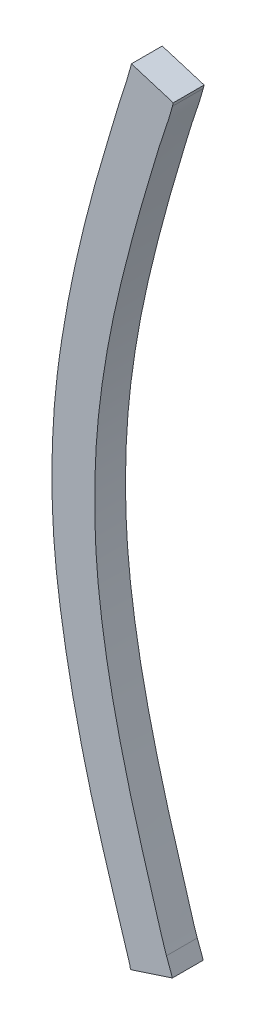
ISO-10303-21;
HEADER;
FILE_DESCRIPTION(('STEP AP214'),'2;1');
FILE_NAME('part.step','',(''),(''),'','','');
FILE_SCHEMA(('AUTOMOTIVE_DESIGN { 1 0 10303 214 1 1 1 1 }'));
ENDSEC;
DATA;
#1=APPLICATION_CONTEXT('core data for automotive mechanical design processes');
#2=APPLICATION_PROTOCOL_DEFINITION('international standard','automotive_design',2000,#1);
#3=PRODUCT_CONTEXT('',#1,'mechanical');
#4=PRODUCT('Part','Part','',(#3));
#5=PRODUCT_RELATED_PRODUCT_CATEGORY('part','',(#4));
#6=PRODUCT_DEFINITION_FORMATION('','',#4);
#7=PRODUCT_DEFINITION_CONTEXT('part definition',#1,'design');
#8=PRODUCT_DEFINITION('design','',#6,#7);
#9=PRODUCT_DEFINITION_SHAPE('','',#8);
#10=(LENGTH_UNIT() NAMED_UNIT(*) SI_UNIT(.MILLI.,.METRE.));
#11=(NAMED_UNIT(*) PLANE_ANGLE_UNIT() SI_UNIT($,.RADIAN.));
#12=(NAMED_UNIT(*) SI_UNIT($,.STERADIAN.) SOLID_ANGLE_UNIT());
#13=UNCERTAINTY_MEASURE_WITH_UNIT(LENGTH_MEASURE(1.E-05),#10,'distance_accuracy_value','');
#14=(GEOMETRIC_REPRESENTATION_CONTEXT(3) GLOBAL_UNCERTAINTY_ASSIGNED_CONTEXT((#13)) GLOBAL_UNIT_ASSIGNED_CONTEXT((#10,
#11,#12)) REPRESENTATION_CONTEXT('',''));
#15=CARTESIAN_POINT('',(0.,0.,0.));
#16=DIRECTION('',(0.,0.,1.));
#17=DIRECTION('',(1.,0.,0.));
#18=AXIS2_PLACEMENT_3D('',#15,#16,#17);
#19=CARTESIAN_POINT('',(60.7958701691964,66.6710436811986,-39.1));
#20=DIRECTION('',(0.,0.,1.));
#21=DIRECTION('',(1.,0.,0.));
#22=AXIS2_PLACEMENT_3D('',#19,#20,#21);
#23=PLANE('',#22);
#24=CARTESIAN_POINT('',(60.9093242956903,65.3880537824811,-39.1));
#25=CARTESIAN_POINT('',(60.9043145744516,65.4039224211055,-39.1));
#26=CARTESIAN_POINT('',(60.8993313666407,65.4197993983538,-39.1));
#27=CARTESIAN_POINT('',(60.8894090701893,65.4515664146494,-39.1));
#28=CARTESIAN_POINT('',(60.8844699797269,65.4674564531274,-39.1));
#29=CARTESIAN_POINT('',(60.8746108316944,65.4992982074446,-39.1));
#30=CARTESIAN_POINT('',(60.8696908857604,65.515249957815,-39.1));
#31=CARTESIAN_POINT('',(60.8598785683024,65.5471627233694,-39.1));
#32=CARTESIAN_POINT('',(60.8549861980328,65.5631237389391,-39.1));
#33=CARTESIAN_POINT('',(60.8402799251201,65.6111693789549,-39.1));
#34=CARTESIAN_POINT('',(60.8304851193492,65.6432598179885,-39.1));
#35=CARTESIAN_POINT('',(60.8112556226589,65.7075484327984,-39.1));
#36=CARTESIAN_POINT('',(60.8018209103206,65.7397466020424,-39.1));
#37=CARTESIAN_POINT('',(60.7837281454986,65.8043649262814,-39.1));
#38=CARTESIAN_POINT('',(60.7750701597987,65.8367851001071,-39.1));
#39=CARTESIAN_POINT('',(60.7584950586661,65.9018137150433,-39.1));
#40=CARTESIAN_POINT('',(60.7505779500766,65.9344221578898,-39.1));
#41=CARTESIAN_POINT('',(60.7355240864214,65.9996529739616,-39.1));
#42=CARTESIAN_POINT('',(60.728383730476,66.0322745114678,-39.1));
#43=CARTESIAN_POINT('',(60.7149649054837,66.0976974416464,-39.1));
#44=CARTESIAN_POINT('',(60.7086865132394,66.1304988500752,-39.1));
#45=CARTESIAN_POINT('',(60.6968908821274,66.1962383388991,-39.1));
#46=CARTESIAN_POINT('',(60.691373661243,66.2291764225045,-39.1));
#47=CARTESIAN_POINT('',(60.6812517967816,66.2951912621979,-39.1));
#48=CARTESIAN_POINT('',(60.6766470143854,66.3282679964084,-39.1));
#49=CARTESIAN_POINT('',(60.6687722310097,66.3950348297252,-39.1));
#50=CARTESIAN_POINT('',(60.6655209549731,66.4287272064063,-39.1));
#51=CARTESIAN_POINT('',(60.6605832606378,66.4962291333749,-39.1));
#52=CARTESIAN_POINT('',(60.6588970160241,66.5300386962497,-39.1));
#53=CARTESIAN_POINT('',(60.6569415602159,66.5976833497231,-39.1));
#54=CARTESIAN_POINT('',(60.656671777525,66.6315184245167,-39.1));
#55=CARTESIAN_POINT('',(60.6575023836958,66.6991692599932,-39.1));
#56=CARTESIAN_POINT('',(60.6586026885523,66.7329850217332,-39.1));
#57=CARTESIAN_POINT('',(60.6621887501934,66.8007757586242,-39.1));
#58=CARTESIAN_POINT('',(60.6646838928858,66.8347502493339,-39.1));
#59=CARTESIAN_POINT('',(60.6711833493845,66.902554898238,-39.1));
#60=CARTESIAN_POINT('',(60.6751877277553,66.936385050195,-39.1));
#61=CARTESIAN_POINT('',(60.6843690652335,67.0038927091767,-39.1));
#62=CARTESIAN_POINT('',(60.6895464464632,67.0375701567874,-39.1));
#63=CARTESIAN_POINT('',(60.7007260682266,67.1047876243946,-39.1));
#64=CARTESIAN_POINT('',(60.7067283116156,67.138327643915,-39.1));
#65=CARTESIAN_POINT('',(60.7193047950785,67.2032564911107,-39.1));
#66=CARTESIAN_POINT('',(60.725824637445,67.2346558295527,-39.1));
#67=CARTESIAN_POINT('',(60.7395911216698,67.2972926267339,-39.1));
#68=CARTESIAN_POINT('',(60.7468377514517,67.3285300881539,-39.1));
#69=CARTESIAN_POINT('',(60.7619010461954,67.3908634012156,-39.1));
#70=CARTESIAN_POINT('',(60.7697176503886,67.4219592675792,-39.1));
#71=CARTESIAN_POINT('',(60.7859559820666,67.4839926615588,-39.1));
#72=CARTESIAN_POINT('',(60.794377702822,67.5149301909316,-39.1));
#73=CARTESIAN_POINT('',(60.8073869907392,67.5610174047168,-39.1));
#74=CARTESIAN_POINT('',(60.8117566872409,67.5762290269035,-39.1));
#75=CARTESIAN_POINT('',(60.8206125754568,67.60661857774,-39.1));
#76=CARTESIAN_POINT('',(60.8250987694561,67.6217965057224,-39.1));
#77=CARTESIAN_POINT('',(60.8341258581609,67.6521365070966,-39.1));
#78=CARTESIAN_POINT('',(60.8386667544368,67.6672985800196,-39.1));
#79=CARTESIAN_POINT('',(60.8476912057924,67.6976393691907,-39.1));
#80=CARTESIAN_POINT('',(60.8521747618447,67.7128180851517,-39.1));
#81=CARTESIAN_POINT('',(60.8611317418558,67.7431718761001,-39.1));
#82=CARTESIAN_POINT('',(60.8656051693697,67.7583469498054,-39.1));
#83=CARTESIAN_POINT('',(60.8748229411846,67.7886148801133,-39.1));
#84=CARTESIAN_POINT('',(60.879567289268,67.8037077355647,-39.1));
#85=CARTESIAN_POINT('',(60.8893151427128,67.8338121724158,-39.1));
#86=CARTESIAN_POINT('',(60.8943186557328,67.8488237513991,-39.1));
#87=CARTESIAN_POINT('',(60.9037994217836,67.8790070706326,-39.1));
#88=CARTESIAN_POINT('',(60.9082766795295,67.8941788094464,-39.1));
#89=CARTESIAN_POINT('',(60.9120982207903,67.9095517020411,-39.1));
#90=B_SPLINE_CURVE_WITH_KNOTS('',3,(#24,#25,#26,#27,#28,#29,#30,#31,#32,#33,#34,#35,#36,#37,#38,
#39,#40,#41,#42,#43,#44,#45,#46,#47,#48,#49,#50,#51,#52,#53,#54,#55,#56,#57,#58,#59,#60,#61,#62,
#63,#64,#65,#66,#67,#68,#69,#70,#71,#72,#73,#74,#75,#76,#77,#78,#79,#80,#81,#82,#83,#84,#85,#86,
#87,#88,#89),.UNSPECIFIED.,.F.,.F.,(4,2,2,2,2,2,2,2,2,2,2,2,2,2,2,2,2,2,2,2,2,2,2,2,2,2,2,2,2,2,
2,2,4),(0.,0.0499218624120883,0.0998416537036679,0.149921340589625,0.200003287339097,
0.300659293450722,0.401309303081491,0.501967958441903,0.602627543466672,0.702798586796466,
0.802978549775832,0.90316087918596,1.00332795504435,1.10483809656498,1.20635950219524,
1.30783994408395,1.40931416412882,1.51147957229387,1.61364935155878,1.71585595669374,
1.81806291563396,1.91425915316305,2.01045379253944,2.1066381909322,2.2028215198612,
2.25030146479508,2.29778234175143,2.34526458513203,2.39274602212263,2.44020683593431,
2.48766831252677,2.53513119247088,2.58259364712009),.UNSPECIFIED.);
#91=CARTESIAN_POINT('',(60.9093242956884,65.3880537824808,-39.1));
#92=VERTEX_POINT('',#91);
#93=CARTESIAN_POINT('',(60.9120982207903,67.9095517020411,-39.1));
#94=VERTEX_POINT('',#93);
#95=EDGE_CURVE('E117',#92,#94,#90,.T.);
#96=ORIENTED_EDGE('',*,*,#95,.T.);
#97=DIRECTION('',(0.242535625039973,0.970142500144422,0.));
#98=VECTOR('',#97,1.);
#99=CARTESIAN_POINT('',(60.9148721458951,67.9206474024599,-39.1));
#100=LINE('',#99,#98);
#101=CARTESIAN_POINT('',(60.914872145895,67.9206474024597,-39.1));
#102=VERTEX_POINT('',#101);
#103=EDGE_CURVE('E131',#94,#102,#100,.T.);
#104=ORIENTED_EDGE('',*,*,#103,.T.);
#105=DIRECTION('',(0.95619995550737,-0.292714272094314,0.));
#106=VECTOR('',#105,1.);
#107=CARTESIAN_POINT('',(61.0507944759928,67.8790385258991,-39.1));
#108=LINE('',#107,#106);
#109=CARTESIAN_POINT('',(61.0507944759919,67.8790385258964,-39.1));
#110=VERTEX_POINT('',#109);
#111=EDGE_CURVE('E137',#102,#110,#108,.T.);
#112=ORIENTED_EDGE('',*,*,#111,.T.);
#113=DIRECTION('',(-0.242535625038331,-0.970142500144832,0.));
#114=VECTOR('',#113,1.);
#115=CARTESIAN_POINT('',(61.0480205508879,67.8679428254817,-39.1));
#116=LINE('',#115,#114);
#117=CARTESIAN_POINT('',(61.0480205508891,67.8679428254814,-39.1));
#118=VERTEX_POINT('',#117);
#119=EDGE_CURVE('E143',#110,#118,#116,.T.);
#120=ORIENTED_EDGE('',*,*,#119,.T.);
#121=CARTESIAN_POINT('',(61.0480205508903,67.8679428254811,-39.1));
#122=CARTESIAN_POINT('',(61.0439915712356,67.8517366635282,-39.1));
#123=CARTESIAN_POINT('',(61.0391223545473,67.835798023788,-39.1));
#124=CARTESIAN_POINT('',(61.0287564063209,67.8041184091699,-39.1));
#125=CARTESIAN_POINT('',(61.0232596743748,67.7883774344206,-39.1));
#126=CARTESIAN_POINT('',(61.0126743235473,67.7567039077578,-39.1));
#127=CARTESIAN_POINT('',(61.0075871030635,67.7407708966897,-39.1));
#128=CARTESIAN_POINT('',(60.9977542725651,67.7088006865625,-39.1));
#129=CARTESIAN_POINT('',(60.993008664572,67.6927634868875,-39.1));
#130=CARTESIAN_POINT('',(60.9834924739786,67.6606574064975,-39.1));
#131=CARTESIAN_POINT('',(60.9787218591218,67.6445885367192,-39.1));
#132=CARTESIAN_POINT('',(60.9691636402412,67.6124558292216,-39.1));
#133=CARTESIAN_POINT('',(60.9643760363428,67.5963919914661,-39.1));
#134=CARTESIAN_POINT('',(60.9501833852663,67.5481510598995,-39.1));
#135=CARTESIAN_POINT('',(60.9409481726815,67.5159234946727,-39.1));
#136=CARTESIAN_POINT('',(60.9230370644909,67.4513060039297,-39.1));
#137=CARTESIAN_POINT('',(60.9143612908222,67.4189160446646,-39.1));
#138=CARTESIAN_POINT('',(60.8974726566221,67.3540143794858,-39.1));
#139=CARTESIAN_POINT('',(60.8892598176141,67.3215026679862,-39.1));
#140=CARTESIAN_POINT('',(60.8735096231019,67.256478106558,-39.1));
#141=CARTESIAN_POINT('',(60.8659692191372,67.2239660087317,-39.1));
#142=CARTESIAN_POINT('',(60.8519135156038,67.1587194441111,-39.1));
#143=CARTESIAN_POINT('',(60.8453981995136,67.1259849809097,-39.1));
#144=CARTESIAN_POINT('',(60.8333856585469,67.0603405600356,-39.1));
#145=CARTESIAN_POINT('',(60.8278881365176,67.0274306564801,-39.1));
#146=CARTESIAN_POINT('',(60.8179832886137,66.9614458833999,-39.1));
#147=CARTESIAN_POINT('',(60.8135759010002,66.9283710233256,-39.1));
#148=CARTESIAN_POINT('',(60.8061408877871,66.8615570812594,-39.1));
#149=CARTESIAN_POINT('',(60.803135132054,66.827815517682,-39.1));
#150=CARTESIAN_POINT('',(60.7986165041744,66.7602304271542,-39.1));
#151=CARTESIAN_POINT('',(60.7971037998209,66.7263868891724,-39.1));
#152=CARTESIAN_POINT('',(60.7954815459725,66.6586678422972,-39.1));
#153=CARTESIAN_POINT('',(60.7953719390386,66.6247923347695,-39.1));
#154=CARTESIAN_POINT('',(60.7966206966505,66.5570720815247,-39.1));
#155=CARTESIAN_POINT('',(60.7979788382,66.5232273319165,-39.1));
#156=CARTESIAN_POINT('',(60.8022722470573,66.455406050314,-39.1));
#157=CARTESIAN_POINT('',(60.8052181452229,66.4214301807032,-39.1));
#158=CARTESIAN_POINT('',(60.8126189385864,66.3536442406892,-39.1));
#159=CARTESIAN_POINT('',(60.8170740626805,66.3198341962254,-39.1));
#160=CARTESIAN_POINT('',(60.8321176014455,66.2186424285987,-39.1));
#161=CARTESIAN_POINT('',(60.8443838638007,66.1515029797264,-39.1));
#162=CARTESIAN_POINT('',(60.8643129964403,66.0587238026394,-39.1));
#163=CARTESIAN_POINT('',(60.870234530564,66.0326938760454,-39.1));
#164=CARTESIAN_POINT('',(60.882525092062,65.98073922907,-39.1));
#165=CARTESIAN_POINT('',(60.8888941278095,65.9548145106667,-39.1));
#166=CARTESIAN_POINT('',(60.9019990952321,65.9030618349992,-39.1));
#167=CARTESIAN_POINT('',(60.9087349734806,65.8772338642272,-39.1));
#168=CARTESIAN_POINT('',(60.9226823308897,65.8257075554701,-39.1));
#169=CARTESIAN_POINT('',(60.9298937968862,65.8000092139179,-39.1));
#170=CARTESIAN_POINT('',(60.9408535292658,65.7616624642494,-39.1));
#171=CARTESIAN_POINT('',(60.944508814253,65.7489869951614,-39.1));
#172=CARTESIAN_POINT('',(60.9518732121326,65.7236519408814,-39.1));
#173=CARTESIAN_POINT('',(60.9555823237847,65.7109923553307,-39.1));
#174=CARTESIAN_POINT('',(60.9630750504445,65.6856946143677,-39.1));
#175=CARTESIAN_POINT('',(60.9668586684625,65.6730564598436,-39.1));
#176=CARTESIAN_POINT('',(60.9745098613374,65.6478056456199,-39.1));
#177=CARTESIAN_POINT('',(60.9783774371653,65.635192986217,-39.1));
#178=CARTESIAN_POINT('',(60.9860987859169,65.6099667512251,-39.1));
#179=CARTESIAN_POINT('',(60.989952562341,65.59735317684,-39.1));
#180=CARTESIAN_POINT('',(60.9974794487539,65.572073249238,-39.1));
#181=CARTESIAN_POINT('',(61.0011525622501,65.5594068970509,-39.1));
#182=CARTESIAN_POINT('',(61.0084833804121,65.5340669954853,-39.1));
#183=CARTESIAN_POINT('',(61.0121410848176,65.5213934459893,-39.1));
#184=CARTESIAN_POINT('',(61.0199124174948,65.4961880735421,-39.1));
#185=CARTESIAN_POINT('',(61.0240261106618,65.4836562710445,-39.1));
#186=CARTESIAN_POINT('',(61.0286030750903,65.4712715356011,-39.1));
#187=B_SPLINE_CURVE_WITH_KNOTS('',3,(#121,#122,#123,#124,#125,#126,#127,#128,#129,#130,#131,
#132,#133,#134,#135,#136,#137,#138,#139,#140,#141,#142,#143,#144,#145,#146,#147,#148,#149,#150,
#151,#152,#153,#154,#155,#156,#157,#158,#159,#160,#161,#162,#163,#164,#165,#166,#167,#168,#169,
#170,#171,#172,#173,#174,#175,#176,#177,#178,#179,#180,#181,#182,#183,#184,#185,#186),
.UNSPECIFIED.,.F.,.F.,(4,2,2,2,2,2,2,2,2,2,2,2,2,2,2,2,2,2,2,2,2,2,2,2,2,2,2,2,2,2,2,2,4),(0.,
0.0500080145666276,0.100016061646279,0.150188208383201,0.200360651978025,0.250647248356933,
0.300933474457003,0.401502619593345,0.502093611529947,0.602689276425291,0.702802863768886,
0.80291483739868,0.902997536313469,1.0030745658297,1.10466477805423,1.2062664059448,
1.3078638745311,1.40944590950309,1.51171669521768,1.61400299873923,1.818587346217,
1.89866936470076,1.97875288198646,2.05882476701014,2.13889443659769,2.17847046458432,
2.21804558217623,2.25762230199392,2.29719947975455,2.33676578330499,2.37633131839219,
2.41589751922909,2.45546935827181),.UNSPECIFIED.);
#188=CARTESIAN_POINT('',(61.0286030750903,65.4712715356011,-39.1));
#189=VERTEX_POINT('',#188);
#190=EDGE_CURVE('E24',#118,#189,#187,.T.);
#191=ORIENTED_EDGE('',*,*,#190,.T.);
#192=DIRECTION('',(0.345705358827352,-0.938343116817112,0.));
#193=VECTOR('',#192,1.);
#194=CARTESIAN_POINT('',(61.048020550825,65.4185669586071,-39.1));
#195=LINE('',#194,#193);
#196=CARTESIAN_POINT('',(61.0480205508241,65.4185669586095,-39.1));
#197=VERTEX_POINT('',#196);
#198=EDGE_CURVE('E83',#189,#197,#195,.T.);
#199=ORIENTED_EDGE('',*,*,#198,.T.);
#200=DIRECTION('',(-0.950605456490995,-0.310401781711295,0.));
#201=VECTOR('',#200,1.);
#202=CARTESIAN_POINT('',(60.9120982207889,65.3741841569654,-39.1));
#203=LINE('',#202,#201);
#204=CARTESIAN_POINT('',(60.9120982207894,65.374184156964,-39.1));
#205=VERTEX_POINT('',#204);
#206=EDGE_CURVE('E90',#197,#205,#203,.T.);
#207=ORIENTED_EDGE('',*,*,#206,.T.);
#208=DIRECTION('',(-0.196116135136651,0.980580675691227,0.));
#209=VECTOR('',#208,1.);
#210=CARTESIAN_POINT('',(60.9093242956865,65.3880537824804,-39.1));
#211=LINE('',#210,#209);
#212=EDGE_CURVE('E125',#205,#92,#211,.T.);
#213=ORIENTED_EDGE('',*,*,#212,.T.);
#214=EDGE_LOOP('',(#96,#104,#112,#120,#191,#199,#207,#213));
#215=FACE_BOUND('',#214,.T.);
#216=ADVANCED_FACE('F17',(#215),#23,.F.);
#217=CARTESIAN_POINT('',(60.9093242956865,65.3880537824804,-39.));
#218=DIRECTION('',(0.980580675691227,0.196116135136651,0.));
#219=DIRECTION('',(-0.196116135136651,0.980580675691227,0.));
#220=AXIS2_PLACEMENT_3D('',#217,#218,#219);
#221=PLANE('',#220);
#222=DIRECTION('',(0.,0.,1.));
#223=VECTOR('',#222,1.);
#224=CARTESIAN_POINT('',(60.9120982207889,65.3741841569654,-39.));
#225=LINE('',#224,#223);
#226=CARTESIAN_POINT('',(60.9120982207898,65.3741841569625,-39.));
#227=VERTEX_POINT('',#226);
#228=EDGE_CURVE('E95',#205,#227,#225,.T.);
#229=ORIENTED_EDGE('',*,*,#228,.T.);
#230=DIRECTION('',(0.196116135134316,-0.980580675691694,0.));
#231=VECTOR('',#230,1.);
#232=CARTESIAN_POINT('',(60.9093242956865,65.3880537824804,-39.));
#233=LINE('',#232,#231);
#234=CARTESIAN_POINT('',(60.9093242956884,65.3880537824808,-39.));
#235=VERTEX_POINT('',#234);
#236=EDGE_CURVE('E115',#235,#227,#233,.T.);
#237=ORIENTED_EDGE('',*,*,#236,.F.);
#238=DIRECTION('',(0.,0.,-1.));
#239=VECTOR('',#238,1.);
#240=CARTESIAN_POINT('',(60.9093242956903,65.3880537824811,-39.05));
#241=LINE('',#240,#239);
#242=EDGE_CURVE('E197',#235,#92,#241,.T.);
#243=ORIENTED_EDGE('',*,*,#242,.T.);
#244=ORIENTED_EDGE('',*,*,#212,.F.);
#245=EDGE_LOOP('',(#229,#237,#243,#244));
#246=FACE_BOUND('',#245,.T.);
#247=ADVANCED_FACE('F183',(#246),#221,.F.);
#248=CARTESIAN_POINT('',(60.9120982207889,65.3741841569654,-39.));
#249=DIRECTION('',(-0.310401781711295,0.950605456490995,0.));
#250=DIRECTION('',(-0.950605456490995,-0.310401781711295,0.));
#251=AXIS2_PLACEMENT_3D('',#248,#249,#250);
#252=PLANE('',#251);
#253=DIRECTION('',(0.,0.,1.));
#254=VECTOR('',#253,1.);
#255=CARTESIAN_POINT('',(61.0480205508241,65.4185669586095,-39.));
#256=LINE('',#255,#254);
#257=CARTESIAN_POINT('',(61.0480205508242,65.4185669586095,-39.));
#258=VERTEX_POINT('',#257);
#259=EDGE_CURVE('E97',#197,#258,#256,.T.);
#260=ORIENTED_EDGE('',*,*,#259,.T.);
#261=DIRECTION('',(0.950605456481307,0.310401781740966,0.));
#262=VECTOR('',#261,1.);
#263=CARTESIAN_POINT('',(60.9120982207903,65.3741841569611,-39.));
#264=LINE('',#263,#262);
#265=EDGE_CURVE('E101',#227,#258,#264,.T.);
#266=ORIENTED_EDGE('',*,*,#265,.F.);
#267=ORIENTED_EDGE('',*,*,#228,.F.);
#268=ORIENTED_EDGE('',*,*,#206,.F.);
#269=EDGE_LOOP('',(#260,#266,#267,#268));
#270=FACE_BOUND('',#269,.T.);
#271=ADVANCED_FACE('F99',(#270),#252,.F.);
#272=CARTESIAN_POINT('',(61.048020550825,65.4185669586071,-39.));
#273=DIRECTION('',(-0.938343116817112,-0.345705358827352,0.));
#274=DIRECTION('',(0.345705358827352,-0.938343116817112,0.));
#275=AXIS2_PLACEMENT_3D('',#272,#273,#274);
#276=PLANE('',#275);
#277=DIRECTION('',(0.,0.,1.));
#278=VECTOR('',#277,1.);
#279=CARTESIAN_POINT('',(61.0286030750903,65.4712715356011,-39.05));
#280=LINE('',#279,#278);
#281=CARTESIAN_POINT('',(61.0286030750903,65.4712715356011,-39.));
#282=VERTEX_POINT('',#281);
#283=EDGE_CURVE('E107',#189,#282,#280,.T.);
#284=ORIENTED_EDGE('',*,*,#283,.T.);
#285=DIRECTION('',(-0.345705358829933,0.938343116816161,0.));
#286=VECTOR('',#285,1.);
#287=CARTESIAN_POINT('',(61.0480205508242,65.4185669586095,-39.));
#288=LINE('',#287,#286);
#289=EDGE_CURVE('E105',#258,#282,#288,.T.);
#290=ORIENTED_EDGE('',*,*,#289,.F.);
#291=ORIENTED_EDGE('',*,*,#259,.F.);
#292=ORIENTED_EDGE('',*,*,#198,.F.);
#293=EDGE_LOOP('',(#284,#290,#291,#292));
#294=FACE_BOUND('',#293,.T.);
#295=ADVANCED_FACE('F106',(#294),#276,.F.);
#296=CARTESIAN_POINT('',(61.0286030750903,65.4712715356011,-39.));
#297=CARTESIAN_POINT('',(61.0286030750903,65.4712715356011,-39.1));
#298=CARTESIAN_POINT('',(61.0172061777903,65.5022059711811,-39.));
#299=CARTESIAN_POINT('',(61.0172061777903,65.5022059711811,-39.1));
#300=CARTESIAN_POINT('',(60.9999058412903,65.5659821748511,-39.));
#301=CARTESIAN_POINT('',(60.9999058412903,65.5659821748511,-39.1));
#302=CARTESIAN_POINT('',(60.9703752940903,65.6604634257111,-39.));
#303=CARTESIAN_POINT('',(60.9703752940903,65.6604634257111,-39.1));
#304=CARTESIAN_POINT('',(60.9424446410903,65.7555881904911,-39.));
#305=CARTESIAN_POINT('',(60.9424446410903,65.7555881904911,-39.1));
#306=CARTESIAN_POINT('',(60.9154263320903,65.8510828608411,-39.));
#307=CARTESIAN_POINT('',(60.9154263320903,65.8510828608411,-39.1));
#308=CARTESIAN_POINT('',(60.8905399314903,65.9472874887411,-39.));
#309=CARTESIAN_POINT('',(60.8905399314903,65.9472874887411,-39.1));
#310=CARTESIAN_POINT('',(60.8673151642903,66.0439631431511,-39.));
#311=CARTESIAN_POINT('',(60.8673151642903,66.0439631431511,-39.1));
#312=CARTESIAN_POINT('',(60.8465477349903,66.1411280540311,-39.));
#313=CARTESIAN_POINT('',(60.8465477349903,66.1411280540311,-39.1));
#314=CARTESIAN_POINT('',(60.8290331732903,66.2387361052611,-39.));
#315=CARTESIAN_POINT('',(60.8290331732903,66.2387361052611,-39.1));
#316=CARTESIAN_POINT('',(60.8143925046903,66.3366485426511,-39.));
#317=CARTESIAN_POINT('',(60.8143925046903,66.3366485426511,-39.1));
#318=CARTESIAN_POINT('',(60.8034669421903,66.4350688603111,-39.));
#319=CARTESIAN_POINT('',(60.8034669421903,66.4350688603111,-39.1));
#320=CARTESIAN_POINT('',(60.7970224355903,66.5341052922411,-39.));
#321=CARTESIAN_POINT('',(60.7970224355903,66.5341052922411,-39.1));
#322=CARTESIAN_POINT('',(60.7948508530903,66.6358584039211,-39.));
#323=CARTESIAN_POINT('',(60.7948508530903,66.6358584039211,-39.1));
#324=CARTESIAN_POINT('',(60.7971208353903,66.7396214222211,-39.));
#325=CARTESIAN_POINT('',(60.7971208353903,66.7396214222211,-39.1));
#326=CARTESIAN_POINT('',(60.8039856532903,66.8446802711711,-39.));
#327=CARTESIAN_POINT('',(60.8039856532903,66.8446802711711,-39.1));
#328=CARTESIAN_POINT('',(60.8156980950903,66.9483503945711,-39.));
#329=CARTESIAN_POINT('',(60.8156980950903,66.9483503945711,-39.1));
#330=CARTESIAN_POINT('',(60.8314586174903,67.0510408543211,-39.));
#331=CARTESIAN_POINT('',(60.8314586174903,67.0510408543211,-39.1));
#332=CARTESIAN_POINT('',(60.8503467341903,67.1532827809011,-39.));
#333=CARTESIAN_POINT('',(60.8503467341903,67.1532827809011,-39.1));
#334=CARTESIAN_POINT('',(60.8728805500903,67.2551487434211,-39.));
#335=CARTESIAN_POINT('',(60.8728805500903,67.2551487434211,-39.1));
#336=CARTESIAN_POINT('',(60.8980094303903,67.3568289901211,-39.));
#337=CARTESIAN_POINT('',(60.8980094303903,67.3568289901211,-39.1));
#338=CARTESIAN_POINT('',(60.9247931968903,67.4585626101411,-39.));
#339=CARTESIAN_POINT('',(60.9247931968903,67.4585626101411,-39.1));
#340=CARTESIAN_POINT('',(60.9534796822903,67.5603545641311,-39.));
#341=CARTESIAN_POINT('',(60.9534796822903,67.5603545641311,-39.1));
#342=CARTESIAN_POINT('',(60.9841376843903,67.6623217389711,-39.));
#343=CARTESIAN_POINT('',(60.9841376843903,67.6623217389711,-39.1));
#344=CARTESIAN_POINT('',(61.0142277012903,67.7653465070011,-39.));
#345=CARTESIAN_POINT('',(61.0142277012903,67.7653465070011,-39.1));
#346=CARTESIAN_POINT('',(61.0392652433903,67.8329215956811,-39.));
#347=CARTESIAN_POINT('',(61.0392652433903,67.8329215956811,-39.1));
#348=CARTESIAN_POINT('',(61.0480205508903,67.8679428254811,-39.));
#349=CARTESIAN_POINT('',(61.0480205508903,67.8679428254811,-39.1));
#350=B_SPLINE_SURFACE_WITH_KNOTS('',3,1,((#296,#297),(#298,#299),(#300,#301),(#302,#303),(#304,
#305),(#306,#307),(#308,#309),(#310,#311),(#312,#313),(#314,#315),(#316,#317),(#318,#319),(#320,
#321),(#322,#323),(#324,#325),(#326,#327),(#328,#329),(#330,#331),(#332,#333),(#334,#335),(#336,
#337),(#338,#339),(#340,#341),(#342,#343),(#344,#345),(#346,#347),(#348,#349)),.UNSPECIFIED.,
.F.,.F.,.F.,(4,1,1,1,1,1,1,1,1,1,1,1,1,1,1,1,1,1,1,1,1,1,1,1,4),(2,2),(0.,0.040278248287,
0.0806030195706,0.120976211563,0.1613914804331,0.2018527253488,0.2423754497267,0.282860879271,
0.3232278266937,0.3635154620948,0.4037973774836,0.444176179008,0.4847294139046,0.5281075982527,
0.5709411647974,0.613316156209,0.655530962379,0.6978516332957,0.7403231878101,0.7829751165553,
0.8258128210892,0.8688486812,0.91217934840788,0.95589519433079,1.),(1.,1.1),.UNSPECIFIED.);
#351=DIRECTION('',(0.,0.,1.));
#352=VECTOR('',#351,1.);
#353=CARTESIAN_POINT('',(61.0480205508879,67.8679428254817,-39.));
#354=LINE('',#353,#352);
#355=CARTESIAN_POINT('',(61.0480205508891,67.8679428254814,-39.));
#356=VERTEX_POINT('',#355);
#357=EDGE_CURVE('E145',#118,#356,#354,.T.);
#358=CARTESIAN_POINT('',(61.0286030750903,65.4712715356011,-39.));
#359=CARTESIAN_POINT('',(61.022837311903,65.4869369549547,-39.));
#360=CARTESIAN_POINT('',(61.0177756750015,65.5028191289054,-39.));
#361=CARTESIAN_POINT('',(61.0081989014491,65.5347524081146,-39.));
#362=CARTESIAN_POINT('',(61.0036837539255,65.5508035100051,-39.));
#363=CARTESIAN_POINT('',(60.9943253410185,65.5828542235398,-39.));
#364=CARTESIAN_POINT('',(60.9894812168997,65.5988535765336,-39.));
#365=CARTESIAN_POINT('',(60.9797226630709,65.6308313231936,-39.));
#366=CARTESIAN_POINT('',(60.9748082317353,65.6468097163659,-39.));
#367=CARTESIAN_POINT('',(60.9602389221578,65.6949295976216,-39.));
#368=CARTESIAN_POINT('',(60.9507968135109,65.727135362519,-39.));
#369=CARTESIAN_POINT('',(60.9322421808691,65.7916435482185,-39.));
#370=CARTESIAN_POINT('',(60.9231296672372,65.8239459720252,-39.));
#371=CARTESIAN_POINT('',(60.9056500952782,65.8887612724291,-39.));
#372=CARTESIAN_POINT('',(60.8972832202083,65.9212741986674,-39.));
#373=CARTESIAN_POINT('',(60.881120710744,65.9864397861142,-39.));
#374=CARTESIAN_POINT('',(60.8733250515373,66.0190924411878,-39.));
#375=CARTESIAN_POINT('',(60.8586224937319,66.0845028378707,-39.));
#376=CARTESIAN_POINT('',(60.8517131185314,66.1172600123611,-39.));
#377=CARTESIAN_POINT('',(60.8389873412138,66.1829887345277,-39.));
#378=CARTESIAN_POINT('',(60.8331710364634,66.2159603010307,-39.));
#379=CARTESIAN_POINT('',(60.8225255365093,66.2820409265251,-39.));
#380=CARTESIAN_POINT('',(60.8176956951035,66.3151498809182,-39.));
#381=CARTESIAN_POINT('',(60.8093568230015,66.3815329834266,-39.));
#382=CARTESIAN_POINT('',(60.8058475663003,66.4148071022871,-39.));
#383=CARTESIAN_POINT('',(60.8003707925801,66.4815286113504,-39.));
#384=CARTESIAN_POINT('',(60.7984054040972,66.5149761769982,-39.));
#385=CARTESIAN_POINT('',(60.7959379761014,66.5819271155906,-39.));
#386=CARTESIAN_POINT('',(60.7954360868806,66.6154304939135,-39.));
#387=CARTESIAN_POINT('',(60.795835661054,66.6824331378755,-39.));
#388=CARTESIAN_POINT('',(60.796737343056,66.7159324020612,-39.));
#389=CARTESIAN_POINT('',(60.799927742547,66.7828653226747,-39.));
#390=CARTESIAN_POINT('',(60.8022163912261,66.8162989822746,-39.));
#391=CARTESIAN_POINT('',(60.8072335729571,66.8712502282108,-39.));
#392=CARTESIAN_POINT('',(60.8095217684912,66.8928087805907,-39.));
#393=CARTESIAN_POINT('',(60.8146655927532,66.9358575753048,-39.));
#394=CARTESIAN_POINT('',(60.8175212188083,66.9573478179601,-39.));
#395=CARTESIAN_POINT('',(60.8237339237035,67.0002581062123,-39.));
#396=CARTESIAN_POINT('',(60.8270910747143,67.021678141252,-39.));
#397=CARTESIAN_POINT('',(60.8342144259563,67.064449683911,-39.));
#398=CARTESIAN_POINT('',(60.8379806227012,67.0858011921127,-39.));
#399=CARTESIAN_POINT('',(60.8459634162671,67.1284616003824,-39.));
#400=CARTESIAN_POINT('',(60.8501808428611,67.149770345914,-39.));
#401=CARTESIAN_POINT('',(60.8590683291676,67.1922926030725,-39.));
#402=CARTESIAN_POINT('',(60.8637383840801,67.2135061157069,-39.));
#403=CARTESIAN_POINT('',(60.8782679736599,67.2770238166438,-39.));
#404=CARTESIAN_POINT('',(60.8886474875586,67.3192080178706,-39.));
#405=CARTESIAN_POINT('',(60.9103675229196,67.4040319137986,-39.));
#406=CARTESIAN_POINT('',(60.921720577391,67.4466683567853,-39.));
#407=CARTESIAN_POINT('',(60.9394448373713,67.5104307556445,-39.));
#408=CARTESIAN_POINT('',(60.945468737861,67.5316529574555,-39.));
#409=CARTESIAN_POINT('',(60.9577634229044,67.5740262294222,-39.));
#410=CARTESIAN_POINT('',(60.9640342168976,67.5951772968245,-39.));
#411=CARTESIAN_POINT('',(60.976559601987,67.6373662046561,-39.));
#412=CARTESIAN_POINT('',(60.9828141117821,67.6584040706146,-39.));
#413=CARTESIAN_POINT('',(60.9921831473805,67.6899651372415,-39.));
#414=CARTESIAN_POINT('',(60.9953040905556,67.7004863825467,-39.));
#415=CARTESIAN_POINT('',(61.0016416435036,67.7214990170634,-39.));
#416=CARTESIAN_POINT('',(61.0048582421564,67.7319904095913,-39.));
#417=CARTESIAN_POINT('',(61.0114788784438,67.7529139463301,-39.));
#418=CARTESIAN_POINT('',(61.0148829085977,67.7633460928874,-39.));
#419=CARTESIAN_POINT('',(61.0218632851719,67.7841519918079,-39.));
#420=CARTESIAN_POINT('',(61.0254396413692,67.7945257408204,-39.));
#421=CARTESIAN_POINT('',(61.0324507302227,67.815323855568,-39.));
#422=CARTESIAN_POINT('',(61.0358854617558,67.8257482217037,-39.));
#423=CARTESIAN_POINT('',(61.0423368104836,67.8467286802744,-39.));
#424=CARTESIAN_POINT('',(61.0453532387462,67.8572848299001,-39.));
#425=CARTESIAN_POINT('',(61.0480205508903,67.8679428254811,-39.));
#426=B_SPLINE_CURVE_WITH_KNOTS('',3,(#358,#359,#360,#361,#362,#363,#364,#365,#366,#367,#368,
#369,#370,#371,#372,#373,#374,#375,#376,#377,#378,#379,#380,#381,#382,#383,#384,#385,#386,#387,
#388,#389,#390,#391,#392,#393,#394,#395,#396,#397,#398,#399,#400,#401,#402,#403,#404,#405,#406,
#407,#408,#409,#410,#411,#412,#413,#414,#415,#416,#417,#418,#419,#420,#421,#422,#423,#424,#425),
.UNSPECIFIED.,.F.,.F.,(4,2,2,2,2,2,2,2,2,2,2,2,2,2,2,2,2,2,2,2,2,2,2,2,2,2,2,2,2,2,2,2,2,4),(0.,
0.0500147149609063,0.100028434683383,0.150178135641947,0.200328998025781,0.301010211702053,
0.401694588225843,0.502403642329667,0.603108319253298,0.703525158329773,0.803950937928785,
0.904310719160453,1.00465331699752,1.10513401586621,1.20562503310728,1.30613170350079,
1.40663338798294,1.47166423077536,1.53669476726521,1.60173467084715,1.66677402015115,
1.73193509662391,1.79709548214279,1.92740754856905,2.05976626068277,2.12594632551909,
2.19212892309246,2.25797283842828,2.29089591289582,2.32381517481961,2.35673312380189,
2.38965294259852,2.42257302242067,2.45550792294245),.UNSPECIFIED.);
#427=EDGE_CURVE('E111',#282,#356,#426,.T.);
#428=ORIENTED_EDGE('',*,*,#357,.T.);
#429=ORIENTED_EDGE('',*,*,#427,.F.);
#430=ORIENTED_EDGE('',*,*,#283,.F.);
#431=ORIENTED_EDGE('',*,*,#190,.F.);
#432=EDGE_LOOP('',(#428,#429,#430,#431));
#433=FACE_BOUND('',#432,.T.);
#434=ADVANCED_FACE('F177',(#433),#350,.F.);
#435=CARTESIAN_POINT('',(61.0480205508879,67.8679428254817,-39.));
#436=DIRECTION('',(-0.970142500144832,0.242535625038331,0.));
#437=DIRECTION('',(-0.242535625038331,-0.970142500144832,0.));
#438=AXIS2_PLACEMENT_3D('',#435,#436,#437);
#439=PLANE('',#438);
#440=DIRECTION('',(0.,0.,1.));
#441=VECTOR('',#440,1.);
#442=CARTESIAN_POINT('',(61.0507944759928,67.8790385258991,-39.));
#443=LINE('',#442,#441);
#444=CARTESIAN_POINT('',(61.0507944759911,67.8790385258938,-39.));
#445=VERTEX_POINT('',#444);
#446=EDGE_CURVE('E140',#110,#445,#443,.T.);
#447=ORIENTED_EDGE('',*,*,#446,.T.);
#448=DIRECTION('',(0.242535624830485,0.970142500196794,0.));
#449=VECTOR('',#448,1.);
#450=CARTESIAN_POINT('',(61.0480205508903,67.8679428254811,-39.));
#451=LINE('',#450,#449);
#452=EDGE_CURVE('E211',#356,#445,#451,.T.);
#453=ORIENTED_EDGE('',*,*,#452,.F.);
#454=ORIENTED_EDGE('',*,*,#357,.F.);
#455=ORIENTED_EDGE('',*,*,#119,.F.);
#456=EDGE_LOOP('',(#447,#453,#454,#455));
#457=FACE_BOUND('',#456,.T.);
#458=ADVANCED_FACE('F173',(#457),#439,.F.);
#459=CARTESIAN_POINT('',(61.0507944759928,67.8790385258991,-39.));
#460=DIRECTION('',(-0.292714272094314,-0.95619995550737,0.));
#461=DIRECTION('',(0.95619995550737,-0.292714272094314,0.));
#462=AXIS2_PLACEMENT_3D('',#459,#460,#461);
#463=PLANE('',#462);
#464=DIRECTION('',(0.,0.,1.));
#465=VECTOR('',#464,1.);
#466=CARTESIAN_POINT('',(60.914872145895,67.9206474024597,-39.));
#467=LINE('',#466,#465);
#468=CARTESIAN_POINT('',(60.914872145895,67.9206474024597,-39.));
#469=VERTEX_POINT('',#468);
#470=EDGE_CURVE('E134',#102,#469,#467,.T.);
#471=ORIENTED_EDGE('',*,*,#470,.T.);
#472=DIRECTION('',(-0.956199955490116,0.292714272150675,0.));
#473=VECTOR('',#472,1.);
#474=CARTESIAN_POINT('',(61.0507944759903,67.8790385258911,-39.));
#475=LINE('',#474,#473);
#476=EDGE_CURVE('E208',#445,#469,#475,.T.);
#477=ORIENTED_EDGE('',*,*,#476,.F.);
#478=ORIENTED_EDGE('',*,*,#446,.F.);
#479=ORIENTED_EDGE('',*,*,#111,.F.);
#480=EDGE_LOOP('',(#471,#477,#478,#479));
#481=FACE_BOUND('',#480,.T.);
#482=ADVANCED_FACE('F170',(#481),#463,.F.);
#483=CARTESIAN_POINT('',(60.9148721458951,67.9206474024599,-39.));
#484=DIRECTION('',(0.970142500144422,-0.242535625039973,0.));
#485=DIRECTION('',(0.242535625039973,0.970142500144422,0.));
#486=AXIS2_PLACEMENT_3D('',#483,#484,#485);
#487=PLANE('',#486);
#488=DIRECTION('',(0.,0.,1.));
#489=VECTOR('',#488,1.);
#490=CARTESIAN_POINT('',(60.9120982207903,67.9095517020411,-39.05));
#491=LINE('',#490,#489);
#492=CARTESIAN_POINT('',(60.9120982207903,67.9095517020411,-39.));
#493=VERTEX_POINT('',#492);
#494=EDGE_CURVE('E44',#94,#493,#491,.T.);
#495=ORIENTED_EDGE('',*,*,#494,.T.);
#496=DIRECTION('',(-0.242535625040616,-0.970142500144261,0.));
#497=VECTOR('',#496,1.);
#498=CARTESIAN_POINT('',(60.914872145895,67.9206474024597,-39.));
#499=LINE('',#498,#497);
#500=EDGE_CURVE('E35',#469,#493,#499,.T.);
#501=ORIENTED_EDGE('',*,*,#500,.F.);
#502=ORIENTED_EDGE('',*,*,#470,.F.);
#503=ORIENTED_EDGE('',*,*,#103,.F.);
#504=EDGE_LOOP('',(#495,#501,#502,#503));
#505=FACE_BOUND('',#504,.T.);
#506=ADVANCED_FACE('F166',(#505),#487,.F.);
#507=CARTESIAN_POINT('',(60.9120982207903,67.9095517020411,-39.));
#508=CARTESIAN_POINT('',(60.9120982207903,67.9095517020411,-39.1));
#509=CARTESIAN_POINT('',(60.9034714246903,67.8750445178511,-39.));
#510=CARTESIAN_POINT('',(60.9034714246903,67.8750445178511,-39.1));
#511=CARTESIAN_POINT('',(60.8798039832903,67.8076442358911,-39.));
#512=CARTESIAN_POINT('',(60.8798039832903,67.8076442358911,-39.1));
#513=CARTESIAN_POINT('',(60.8499912076903,67.7046821442411,-39.));
#514=CARTESIAN_POINT('',(60.8499912076903,67.7046821442411,-39.1));
#515=CARTESIAN_POINT('',(60.8188483337903,67.6016031320011,-39.));
#516=CARTESIAN_POINT('',(60.8188483337903,67.6016031320011,-39.1));
#517=CARTESIAN_POINT('',(60.7893072446903,67.4976279515811,-39.));
#518=CARTESIAN_POINT('',(60.7893072446903,67.4976279515811,-39.1));
#519=CARTESIAN_POINT('',(60.7620785894903,67.3926422512311,-39.));
#520=CARTESIAN_POINT('',(60.7620785894903,67.3926422512311,-39.1));
#521=CARTESIAN_POINT('',(60.7368871273903,67.2868477946411,-39.));
#522=CARTESIAN_POINT('',(60.7368871273903,67.2868477946411,-39.1));
#523=CARTESIAN_POINT('',(60.7142968776903,67.1802658615211,-39.));
#524=CARTESIAN_POINT('',(60.7142968776903,67.1802658615211,-39.1));
#525=CARTESIAN_POINT('',(60.6949493742903,67.0729497432511,-39.));
#526=CARTESIAN_POINT('',(60.6949493742903,67.0729497432511,-39.1));
#527=CARTESIAN_POINT('',(60.6783810173903,66.9649456532711,-39.));
#528=CARTESIAN_POINT('',(60.6783810173903,66.9649456532711,-39.1));
#529=CARTESIAN_POINT('',(60.6658420294903,66.8557941923511,-39.));
#530=CARTESIAN_POINT('',(60.6658420294903,66.8557941923511,-39.1));
#531=CARTESIAN_POINT('',(60.6585309833903,66.7451769925511,-39.));
#532=CARTESIAN_POINT('',(60.6585309833903,66.7451769925511,-39.1));
#533=CARTESIAN_POINT('',(60.6560771001903,66.6347274988212,-39.));
#534=CARTESIAN_POINT('',(60.6560771001903,66.6347274988212,-39.1));
#535=CARTESIAN_POINT('',(60.6585240842903,66.5253539658611,-39.));
#536=CARTESIAN_POINT('',(60.6585240842903,66.5253539658611,-39.1));
#537=CARTESIAN_POINT('',(60.6658531821903,66.4179697436011,-39.));
#538=CARTESIAN_POINT('',(60.6658531821903,66.4179697436011,-39.1));
#539=CARTESIAN_POINT('',(60.6784167928903,66.3118095911711,-39.));
#540=CARTESIAN_POINT('',(60.6784167928903,66.3118095911711,-39.1));
#541=CARTESIAN_POINT('',(60.6948455977903,66.2066484773211,-39.));
#542=CARTESIAN_POINT('',(60.6948455977903,66.2066484773211,-39.1));
#543=CARTESIAN_POINT('',(60.7137364321903,66.1021154829911,-39.));
#544=CARTESIAN_POINT('',(60.7137364321903,66.1021154829911,-39.1));
#545=CARTESIAN_POINT('',(60.7355141657903,65.9982296608211,-39.));
#546=CARTESIAN_POINT('',(60.7355141657903,65.9982296608211,-39.1));
#547=CARTESIAN_POINT('',(60.7599088236903,65.8949694947611,-39.));
#548=CARTESIAN_POINT('',(60.7599088236903,65.8949694947611,-39.1));
#549=CARTESIAN_POINT('',(60.7866680766903,65.7922865190211,-39.));
#550=CARTESIAN_POINT('',(60.7866680766903,65.7922865190211,-39.1));
#551=CARTESIAN_POINT('',(60.8161404543903,65.6904029871811,-39.));
#552=CARTESIAN_POINT('',(60.8161404543903,65.6904029871811,-39.1));
#553=CARTESIAN_POINT('',(60.8469813804903,65.5891578711811,-39.));
#554=CARTESIAN_POINT('',(60.8469813804903,65.5891578711811,-39.1));
#555=CARTESIAN_POINT('',(60.8779155843903,65.4883582177612,-39.));
#556=CARTESIAN_POINT('',(60.8779155843903,65.4883582177612,-39.1));
#557=CARTESIAN_POINT('',(60.8987934945903,65.4214116328112,-39.));
#558=CARTESIAN_POINT('',(60.8987934945903,65.4214116328112,-39.1));
#559=CARTESIAN_POINT('',(60.9093242956903,65.3880537824811,-39.));
#560=CARTESIAN_POINT('',(60.9093242956903,65.3880537824811,-39.1));
#561=B_SPLINE_SURFACE_WITH_KNOTS('',3,1,((#507,#508),(#509,#510),(#511,#512),(#513,#514),(#515,
#516),(#517,#518),(#519,#520),(#521,#522),(#523,#524),(#525,#526),(#527,#528),(#529,#530),(#531,
#532),(#533,#534),(#535,#536),(#537,#538),(#539,#540),(#541,#542),(#543,#544),(#545,#546),(#547,
#548),(#549,#550),(#551,#552),(#553,#554),(#555,#556),(#557,#558),(#559,#560)),.UNSPECIFIED.,
.F.,.F.,.F.,(4,1,1,1,1,1,1,1,1,1,1,1,1,1,1,1,1,1,1,1,1,1,1,1,4),(2,2),(0.,0.0413184722059,
0.0828305644182,0.1245370853061,0.1663972145159,0.2083840662625,0.2505168707437,0.2927190031333,
0.3349258601963,0.3771725185111,0.4196299114956,0.4625105662135,0.5059026791283,0.5479226771341,
0.5895531007979,0.6308841100529,0.6720599694941,0.7131780218303,0.7542676600694,0.7953446009062,
0.8364201547581,0.8775178947493,0.91853849498568,0.95936558638094,1.),(1.,1.1),.UNSPECIFIED.);
#562=CARTESIAN_POINT('',(60.9120982207903,67.9095517020411,-39.));
#563=CARTESIAN_POINT('',(60.9080665186083,67.8933576316954,-39.));
#564=CARTESIAN_POINT('',(60.9033174973871,67.8773846824852,-39.));
#565=CARTESIAN_POINT('',(60.8932787157197,67.8456047553228,-39.));
#566=CARTESIAN_POINT('',(60.8879889772808,67.8297977706446,-39.));
#567=CARTESIAN_POINT('',(60.8777477641815,67.7980274878703,-39.));
#568=CARTESIAN_POINT('',(60.8727972856771,67.7820638746399,-39.));
#569=CARTESIAN_POINT('',(60.8631420388656,67.7500623457538,-39.));
#570=CARTESIAN_POINT('',(60.858437281127,67.7340244269344,-39.));
#571=CARTESIAN_POINT('',(60.8489614144594,67.7019237340227,-39.));
#572=CARTESIAN_POINT('',(60.8441901663757,67.6858610015814,-39.));
#573=CARTESIAN_POINT('',(60.8346158436495,67.6537450015864,-39.));
#574=CARTESIAN_POINT('',(60.8298127688947,67.6376917340663,-39.));
#575=CARTESIAN_POINT('',(60.8155503003894,67.5894893871839,-39.));
#576=CARTESIAN_POINT('',(60.8062371971467,67.5572962586034,-39.));
#577=CARTESIAN_POINT('',(60.7882923731882,67.4927192422324,-39.));
#578=CARTESIAN_POINT('',(60.779660667025,67.4603353503838,-39.));
#579=CARTESIAN_POINT('',(60.7630218288607,67.3954062596065,-39.));
#580=CARTESIAN_POINT('',(60.7550147306534,67.3628610520512,-39.));
#581=CARTESIAN_POINT('',(60.7396991841203,67.2977573357538,-39.));
#582=CARTESIAN_POINT('',(60.7323878013799,67.2651995229679,-39.));
#583=CARTESIAN_POINT('',(60.7186284019571,67.199900563657,-39.));
#584=CARTESIAN_POINT('',(60.7121803931844,67.1671594154552,-39.));
#585=CARTESIAN_POINT('',(60.7001394596877,67.1015160339337,-39.));
#586=CARTESIAN_POINT('',(60.6945466663113,67.0686137766695,-39.));
#587=CARTESIAN_POINT('',(60.6842328817626,67.0026724048024,-39.));
#588=CARTESIAN_POINT('',(60.6795118323735,66.9696332994894,-39.));
#589=CARTESIAN_POINT('',(60.6726385060055,66.914121615823,-39.));
#590=CARTESIAN_POINT('',(60.6701494280039,66.8916912353521,-39.));
#591=CARTESIAN_POINT('',(60.6658288266475,66.8467678461456,-39.));
#592=CARTESIAN_POINT('',(60.66399727594,66.8242748400543,-39.));
#593=CARTESIAN_POINT('',(60.6609721182739,66.7792507149087,-39.));
#594=CARTESIAN_POINT('',(60.659778386307,66.7567196041916,-39.));
#595=CARTESIAN_POINT('',(60.6579888666259,66.7116334555991,-39.));
#596=CARTESIAN_POINT('',(60.6573931051721,66.6890784167165,-39.));
#597=CARTESIAN_POINT('',(60.6565198709363,66.6214316407281,-39.));
#598=CARTESIAN_POINT('',(60.6571541631609,66.5763241104839,-39.));
#599=CARTESIAN_POINT('',(60.6610359087835,66.4859293500221,-39.));
#600=CARTESIAN_POINT('',(60.6643000069262,66.4406428091803,-39.));
#601=CARTESIAN_POINT('',(60.6736130893035,66.3503408289246,-39.));
#602=CARTESIAN_POINT('',(60.6796634916115,66.3053255393954,-39.));
#603=CARTESIAN_POINT('',(60.6900376114141,66.2380118906919,-39.));
#604=CARTESIAN_POINT('',(60.6937126616332,66.2156058416062,-39.));
#605=CARTESIAN_POINT('',(60.7013978921758,66.1708512692495,-39.));
#606=CARTESIAN_POINT('',(60.7054080615624,66.1485027441256,-39.));
#607=CARTESIAN_POINT('',(60.7215170908861,66.0631571389548,-39.));
#608=CARTESIAN_POINT('',(60.7350200425683,66.0004197397622,-39.));
#609=CARTESIAN_POINT('',(60.7572740819641,65.9068096555002,-39.));
#610=CARTESIAN_POINT('',(60.7650246404825,65.8756915148325,-39.));
#611=CARTESIAN_POINT('',(60.7812370410556,65.8136404298999,-39.));
#612=CARTESIAN_POINT('',(60.7896988600358,65.782707479662,-39.));
#613=CARTESIAN_POINT('',(60.8071687448313,65.721381775956,-39.));
#614=CARTESIAN_POINT('',(60.8161694306022,65.6909868963066,-39.));
#615=CARTESIAN_POINT('',(60.8344347466244,65.6302756977447,-39.));
#616=CARTESIAN_POINT('',(60.8436993933524,65.5999593838657,-39.));
#617=CARTESIAN_POINT('',(60.8622751984388,65.5393504266944,-39.));
#618=CARTESIAN_POINT('',(60.871586342661,65.5090577791028,-39.));
#619=CARTESIAN_POINT('',(60.8903378213689,65.448517024157,-39.));
#620=CARTESIAN_POINT('',(60.8997781383124,65.4182689113608,-39.));
#621=CARTESIAN_POINT('',(60.9093242956903,65.3880537824811,-39.));
#622=B_SPLINE_CURVE_WITH_KNOTS('',3,(#562,#563,#564,#565,#566,#567,#568,#569,#570,#571,#572,
#573,#574,#575,#576,#577,#578,#579,#580,#581,#582,#583,#584,#585,#586,#587,#588,#589,#590,#591,
#592,#593,#594,#595,#596,#597,#598,#599,#600,#601,#602,#603,#604,#605,#606,#607,#608,#609,#610,
#611,#612,#613,#614,#615,#616,#617,#618,#619,#620,#621),.UNSPECIFIED.,.F.,.F.,(4,2,2,2,2,2,2,2,
2,2,2,2,2,2,2,2,2,2,2,2,2,2,2,2,2,2,2,2,2,4),(0.,0.0499995066746375,0.0999969791492233,
0.150135469776993,0.200276115093277,0.250545273095304,0.300814608375676,0.401348553523773,
0.501884645180113,0.602426172457983,0.702522855856506,0.802620456217756,0.902733414587557,
1.00283968480063,1.07053518033294,1.13822785945309,1.20590726636924,1.27358964534333,
1.40885190389437,1.54497706270541,1.68117157832979,1.7492874525373,1.81740110459879,
2.00983671210535,2.1060386134906,2.20223739512993,2.29733260149206,2.39243375682386,
2.48750757384494,2.58256860509717),.UNSPECIFIED.);
#623=EDGE_CURVE('E11',#493,#235,#622,.T.);
#624=ORIENTED_EDGE('',*,*,#242,.F.);
#625=ORIENTED_EDGE('',*,*,#623,.F.);
#626=ORIENTED_EDGE('',*,*,#494,.F.);
#627=ORIENTED_EDGE('',*,*,#95,.F.);
#628=EDGE_LOOP('',(#624,#625,#626,#627));
#629=FACE_BOUND('',#628,.T.);
#630=ADVANCED_FACE('F19',(#629),#561,.F.);
#631=CARTESIAN_POINT('',(60.7958701691964,66.6710436811986,-39.));
#632=DIRECTION('',(0.,0.,1.));
#633=DIRECTION('',(1.,0.,0.));
#634=AXIS2_PLACEMENT_3D('',#631,#632,#633);
#635=PLANE('',#634);
#636=ORIENTED_EDGE('',*,*,#500,.T.);
#637=ORIENTED_EDGE('',*,*,#623,.T.);
#638=ORIENTED_EDGE('',*,*,#236,.T.);
#639=ORIENTED_EDGE('',*,*,#265,.T.);
#640=ORIENTED_EDGE('',*,*,#289,.T.);
#641=ORIENTED_EDGE('',*,*,#427,.T.);
#642=ORIENTED_EDGE('',*,*,#452,.T.);
#643=ORIENTED_EDGE('',*,*,#476,.T.);
#644=EDGE_LOOP('',(#636,#637,#638,#639,#640,#641,#642,#643));
#645=FACE_BOUND('',#644,.T.);
#646=ADVANCED_FACE('F114',(#645),#635,.T.);
#647=CLOSED_SHELL('',(#216,#247,#271,#295,#434,#458,#482,#506,#630,#646));
#648=MANIFOLD_SOLID_BREP('B1',#647);
#649=ADVANCED_BREP_SHAPE_REPRESENTATION('',(#18,#648),#14);
#650=SHAPE_DEFINITION_REPRESENTATION(#9,#649);
ENDSEC;
END-ISO-10303-21;
